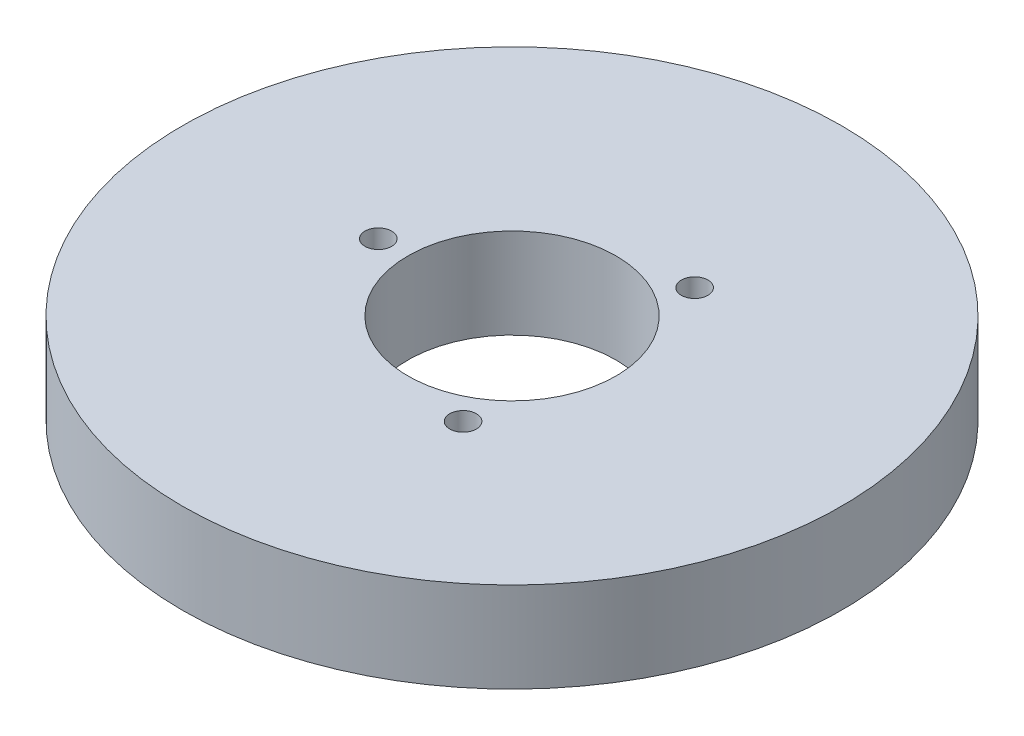
ISO-10303-21;
HEADER;
FILE_DESCRIPTION(('STEP AP214'),'2;1');
FILE_NAME('part.step','',(''),(''),'','','');
FILE_SCHEMA(('AUTOMOTIVE_DESIGN { 1 0 10303 214 1 1 1 1 }'));
ENDSEC;
DATA;
#1=APPLICATION_CONTEXT('core data for automotive mechanical design processes');
#2=APPLICATION_PROTOCOL_DEFINITION('international standard','automotive_design',2000,#1);
#3=PRODUCT_CONTEXT('',#1,'mechanical');
#4=PRODUCT('Part','Part','',(#3));
#5=PRODUCT_RELATED_PRODUCT_CATEGORY('part','',(#4));
#6=PRODUCT_DEFINITION_FORMATION('','',#4);
#7=PRODUCT_DEFINITION_CONTEXT('part definition',#1,'design');
#8=PRODUCT_DEFINITION('design','',#6,#7);
#9=PRODUCT_DEFINITION_SHAPE('','',#8);
#10=(LENGTH_UNIT() NAMED_UNIT(*) SI_UNIT(.MILLI.,.METRE.));
#11=(NAMED_UNIT(*) PLANE_ANGLE_UNIT() SI_UNIT($,.RADIAN.));
#12=(NAMED_UNIT(*) SI_UNIT($,.STERADIAN.) SOLID_ANGLE_UNIT());
#13=UNCERTAINTY_MEASURE_WITH_UNIT(LENGTH_MEASURE(1.E-05),#10,'distance_accuracy_value','');
#14=(GEOMETRIC_REPRESENTATION_CONTEXT(3) GLOBAL_UNCERTAINTY_ASSIGNED_CONTEXT((#13)) GLOBAL_UNIT_ASSIGNED_CONTEXT((#10,
#11,#12)) REPRESENTATION_CONTEXT('',''));
#15=CARTESIAN_POINT('',(0.,0.,0.));
#16=DIRECTION('',(0.,0.,1.));
#17=DIRECTION('',(1.,0.,0.));
#18=AXIS2_PLACEMENT_3D('',#15,#16,#17);
#19=CARTESIAN_POINT('',(0.,13.,0.));
#20=DIRECTION('',(0.,-1.,0.));
#21=DIRECTION('',(0.,0.,-1.));
#22=AXIS2_PLACEMENT_3D('',#19,#20,#21);
#23=CYLINDRICAL_SURFACE('',#22,47.5);
#24=CARTESIAN_POINT('',(0.,13.,0.));
#25=DIRECTION('',(0.,1.,0.));
#26=DIRECTION('',(0.,0.,1.));
#27=AXIS2_PLACEMENT_3D('',#24,#25,#26);
#28=CIRCLE('',#27,47.5);
#29=CARTESIAN_POINT('',(0.,13.,-47.5));
#30=VERTEX_POINT('',#29);
#31=EDGE_CURVE('E10',#30,#30,#28,.T.);
#32=CARTESIAN_POINT('',(0.,0.,0.));
#33=DIRECTION('',(0.,1.,0.));
#34=DIRECTION('',(0.,0.,1.));
#35=AXIS2_PLACEMENT_3D('',#32,#33,#34);
#36=CIRCLE('',#35,47.5);
#37=CARTESIAN_POINT('',(0.,0.,-47.5));
#38=VERTEX_POINT('',#37);
#39=EDGE_CURVE('E37',#38,#38,#36,.T.);
#40=CARTESIAN_POINT('',(0.,13.,-47.5));
#41=CARTESIAN_POINT('',(0.,12.8645833333333,-47.5));
#42=CARTESIAN_POINT('',(0.,12.7291666666667,-47.5));
#43=CARTESIAN_POINT('',(0.,12.4583333333333,-47.5));
#44=CARTESIAN_POINT('',(0.,12.3229166666667,-47.5));
#45=CARTESIAN_POINT('',(0.,12.0520833333333,-47.5));
#46=CARTESIAN_POINT('',(0.,11.9166666666667,-47.5));
#47=CARTESIAN_POINT('',(0.,11.6458333333333,-47.5));
#48=CARTESIAN_POINT('',(0.,11.5104166666667,-47.5));
#49=CARTESIAN_POINT('',(0.,11.2395833333333,-47.5));
#50=CARTESIAN_POINT('',(0.,11.1041666666667,-47.5));
#51=CARTESIAN_POINT('',(0.,10.8333333333333,-47.5));
#52=CARTESIAN_POINT('',(0.,10.6979166666667,-47.5));
#53=CARTESIAN_POINT('',(0.,10.4270833333333,-47.5));
#54=CARTESIAN_POINT('',(0.,10.2916666666667,-47.5));
#55=CARTESIAN_POINT('',(0.,10.0208333333333,-47.5));
#56=CARTESIAN_POINT('',(0.,9.88541666666667,-47.5));
#57=CARTESIAN_POINT('',(0.,9.61458333333333,-47.5));
#58=CARTESIAN_POINT('',(0.,9.47916666666667,-47.5));
#59=CARTESIAN_POINT('',(0.,9.20833333333333,-47.5));
#60=CARTESIAN_POINT('',(0.,9.07291666666666,-47.5));
#61=CARTESIAN_POINT('',(0.,8.80208333333333,-47.5));
#62=CARTESIAN_POINT('',(0.,8.66666666666667,-47.5));
#63=CARTESIAN_POINT('',(0.,8.39583333333333,-47.5));
#64=CARTESIAN_POINT('',(0.,8.26041666666667,-47.5));
#65=CARTESIAN_POINT('',(0.,7.98958333333333,-47.5));
#66=CARTESIAN_POINT('',(0.,7.85416666666667,-47.5));
#67=CARTESIAN_POINT('',(0.,7.58333333333333,-47.5));
#68=CARTESIAN_POINT('',(0.,7.44791666666667,-47.5));
#69=CARTESIAN_POINT('',(0.,7.17708333333333,-47.5));
#70=CARTESIAN_POINT('',(0.,7.04166666666667,-47.5));
#71=CARTESIAN_POINT('',(0.,6.77083333333333,-47.5));
#72=CARTESIAN_POINT('',(0.,6.63541666666667,-47.5));
#73=CARTESIAN_POINT('',(0.,6.36458333333333,-47.5));
#74=CARTESIAN_POINT('',(0.,6.22916666666667,-47.5));
#75=CARTESIAN_POINT('',(0.,5.95833333333333,-47.5));
#76=CARTESIAN_POINT('',(0.,5.82291666666667,-47.5));
#77=CARTESIAN_POINT('',(0.,5.55208333333333,-47.5));
#78=CARTESIAN_POINT('',(0.,5.41666666666667,-47.5));
#79=CARTESIAN_POINT('',(0.,5.14583333333333,-47.5));
#80=CARTESIAN_POINT('',(0.,5.01041666666667,-47.5));
#81=CARTESIAN_POINT('',(0.,4.73958333333333,-47.5));
#82=CARTESIAN_POINT('',(0.,4.60416666666667,-47.5));
#83=CARTESIAN_POINT('',(0.,4.33333333333333,-47.5));
#84=CARTESIAN_POINT('',(0.,4.19791666666667,-47.5));
#85=CARTESIAN_POINT('',(0.,3.92708333333333,-47.5));
#86=CARTESIAN_POINT('',(0.,3.79166666666667,-47.5));
#87=CARTESIAN_POINT('',(0.,3.52083333333333,-47.5));
#88=CARTESIAN_POINT('',(0.,3.38541666666667,-47.5));
#89=CARTESIAN_POINT('',(0.,3.11458333333333,-47.5));
#90=CARTESIAN_POINT('',(0.,2.97916666666667,-47.5));
#91=CARTESIAN_POINT('',(0.,2.70833333333333,-47.5));
#92=CARTESIAN_POINT('',(0.,2.57291666666667,-47.5));
#93=CARTESIAN_POINT('',(0.,2.30208333333333,-47.5));
#94=CARTESIAN_POINT('',(0.,2.16666666666667,-47.5));
#95=CARTESIAN_POINT('',(0.,1.89583333333333,-47.5));
#96=CARTESIAN_POINT('',(0.,1.76041666666667,-47.5));
#97=CARTESIAN_POINT('',(0.,1.48958333333333,-47.5));
#98=CARTESIAN_POINT('',(0.,1.35416666666667,-47.5));
#99=CARTESIAN_POINT('',(0.,1.08333333333333,-47.5));
#100=CARTESIAN_POINT('',(0.,0.947916666666667,-47.5));
#101=CARTESIAN_POINT('',(0.,0.677083333333334,-47.5));
#102=CARTESIAN_POINT('',(0.,0.541666666666667,-47.5));
#103=CARTESIAN_POINT('',(0.,0.270833333333334,-47.5));
#104=CARTESIAN_POINT('',(0.,0.135416666666667,-47.5));
#105=CARTESIAN_POINT('',(0.,0.,-47.5));
#106=B_SPLINE_CURVE_WITH_KNOTS('',3,(#40,#41,#42,#43,#44,#45,#46,#47,#48,#49,#50,#51,#52,#53,
#54,#55,#56,#57,#58,#59,#60,#61,#62,#63,#64,#65,#66,#67,#68,#69,#70,#71,#72,#73,#74,#75,#76,#77,
#78,#79,#80,#81,#82,#83,#84,#85,#86,#87,#88,#89,#90,#91,#92,#93,#94,#95,#96,#97,#98,#99,#100,
#101,#102,#103,#104,#105),.UNSPECIFIED.,.F.,.F.,(4,2,2,2,2,2,2,2,2,2,2,2,2,2,2,2,2,2,2,2,2,2,2,
2,2,2,2,2,2,2,2,2,4),(0.,0.40625,0.812500000000001,1.21875,1.625,2.03125,2.4375,2.84375,3.25,
3.65625,4.0625,4.46875,4.875,5.28125,5.6875,6.09375,6.5,6.90625,7.3125,7.71875,8.125,8.53125,
8.9375,9.34375,9.75,10.15625,10.5625,10.96875,11.375,11.78125,12.1875,12.59375,13.),.UNSPECIFIED.);
#107=EDGE_CURVE('BSEAM40',#30,#38,#106,.T.);
#108=ORIENTED_EDGE('',*,*,#31,.F.);
#109=ORIENTED_EDGE('',*,*,#39,.T.);
#110=ORIENTED_EDGE('',*,*,#107,.T.);
#111=ORIENTED_EDGE('',*,*,#107,.F.);
#112=EDGE_LOOP('',(#108,#110,#109,#111));
#113=FACE_BOUND('',#112,.T.);
#114=ADVANCED_FACE('F40',(#113),#23,.T.);
#115=CARTESIAN_POINT('',(0.,13.,0.));
#116=DIRECTION('',(0.,1.,0.));
#117=DIRECTION('',(0.,0.,1.));
#118=AXIS2_PLACEMENT_3D('',#115,#116,#117);
#119=PLANE('',#118);
#120=CARTESIAN_POINT('',(9.63567687789296,13.,16.6894819178271));
#121=DIRECTION('',(0.,1.,0.));
#122=DIRECTION('',(0.866025403784436,0.,-0.500000000000004));
#123=AXIS2_PLACEMENT_3D('',#120,#121,#122);
#124=CIRCLE('',#123,1.91689370131754);
#125=CARTESIAN_POINT('',(11.2957555195883,13.,15.7310350671683));
#126=VERTEX_POINT('',#125);
#127=EDGE_CURVE('E70',#126,#126,#124,.T.);
#128=ORIENTED_EDGE('',*,*,#127,.F.);
#129=EDGE_LOOP('',(#128));
#130=FACE_BOUND('',#129,.T.);
#131=CARTESIAN_POINT('',(9.63567687789273,13.,-16.6894819178272));
#132=DIRECTION('',(0.,1.,0.));
#133=DIRECTION('',(-0.866025403784443,0.,-0.499999999999992));
#134=AXIS2_PLACEMENT_3D('',#131,#132,#133);
#135=CIRCLE('',#134,1.91689370131754);
#136=CARTESIAN_POINT('',(7.97559823619735,13.,-17.647928768486));
#137=VERTEX_POINT('',#136);
#138=EDGE_CURVE('E61',#137,#137,#135,.T.);
#139=ORIENTED_EDGE('',*,*,#138,.F.);
#140=EDGE_LOOP('',(#139));
#141=FACE_BOUND('',#140,.T.);
#142=CARTESIAN_POINT('',(-19.2713537557858,13.,0.));
#143=DIRECTION('',(0.,1.,0.));
#144=DIRECTION('',(0.,0.,1.));
#145=AXIS2_PLACEMENT_3D('',#142,#143,#144);
#146=CIRCLE('',#145,1.91689370131754);
#147=CARTESIAN_POINT('',(-19.2713537557858,13.,1.91689370131754));
#148=VERTEX_POINT('',#147);
#149=EDGE_CURVE('E54',#148,#148,#146,.T.);
#150=ORIENTED_EDGE('',*,*,#149,.F.);
#151=EDGE_LOOP('',(#150));
#152=FACE_BOUND('',#151,.T.);
#153=CARTESIAN_POINT('',(0.,13.,0.));
#154=DIRECTION('',(0.,1.,0.));
#155=DIRECTION('',(0.,0.,1.));
#156=AXIS2_PLACEMENT_3D('',#153,#154,#155);
#157=CIRCLE('',#156,15.);
#158=CARTESIAN_POINT('',(0.,13.,-15.));
#159=VERTEX_POINT('',#158);
#160=EDGE_CURVE('E50',#159,#159,#157,.T.);
#161=ORIENTED_EDGE('',*,*,#160,.F.);
#162=EDGE_LOOP('',(#161));
#163=FACE_BOUND('',#162,.T.);
#164=ORIENTED_EDGE('',*,*,#31,.T.);
#165=EDGE_LOOP('',(#164));
#166=FACE_BOUND('',#165,.T.);
#167=ADVANCED_FACE('F85',(#130,#141,#152,#163,#166),#119,.T.);
#168=CARTESIAN_POINT('',(0.,0.,0.));
#169=DIRECTION('',(0.,1.,0.));
#170=DIRECTION('',(0.,0.,1.));
#171=AXIS2_PLACEMENT_3D('',#168,#169,#170);
#172=PLANE('',#171);
#173=CARTESIAN_POINT('',(0.,0.,0.));
#174=DIRECTION('',(0.,1.,0.));
#175=DIRECTION('',(0.,0.,1.));
#176=AXIS2_PLACEMENT_3D('',#173,#174,#175);
#177=CIRCLE('',#176,15.);
#178=CARTESIAN_POINT('',(0.,0.,-15.));
#179=VERTEX_POINT('',#178);
#180=EDGE_CURVE('E47',#179,#179,#177,.T.);
#181=ORIENTED_EDGE('',*,*,#180,.T.);
#182=EDGE_LOOP('',(#181));
#183=FACE_BOUND('',#182,.T.);
#184=ORIENTED_EDGE('',*,*,#39,.F.);
#185=EDGE_LOOP('',(#184));
#186=FACE_BOUND('',#185,.T.);
#187=ADVANCED_FACE('F84',(#183,#186),#172,.F.);
#188=CARTESIAN_POINT('',(0.,13.,0.));
#189=DIRECTION('',(0.,-1.,0.));
#190=DIRECTION('',(0.,0.,-1.));
#191=AXIS2_PLACEMENT_3D('',#188,#189,#190);
#192=CYLINDRICAL_SURFACE('',#191,15.);
#193=CARTESIAN_POINT('',(0.,13.,-15.));
#194=CARTESIAN_POINT('',(0.,12.8645833333333,-15.));
#195=CARTESIAN_POINT('',(0.,12.7291666666667,-15.));
#196=CARTESIAN_POINT('',(0.,12.4583333333333,-15.));
#197=CARTESIAN_POINT('',(0.,12.3229166666667,-15.));
#198=CARTESIAN_POINT('',(0.,12.0520833333333,-15.));
#199=CARTESIAN_POINT('',(0.,11.9166666666667,-15.));
#200=CARTESIAN_POINT('',(0.,11.6458333333333,-15.));
#201=CARTESIAN_POINT('',(0.,11.5104166666667,-15.));
#202=CARTESIAN_POINT('',(0.,11.2395833333333,-15.));
#203=CARTESIAN_POINT('',(0.,11.1041666666667,-15.));
#204=CARTESIAN_POINT('',(0.,10.8333333333333,-15.));
#205=CARTESIAN_POINT('',(0.,10.6979166666667,-15.));
#206=CARTESIAN_POINT('',(0.,10.4270833333333,-15.));
#207=CARTESIAN_POINT('',(0.,10.2916666666667,-15.));
#208=CARTESIAN_POINT('',(0.,10.0208333333333,-15.));
#209=CARTESIAN_POINT('',(0.,9.88541666666667,-15.));
#210=CARTESIAN_POINT('',(0.,9.61458333333333,-15.));
#211=CARTESIAN_POINT('',(0.,9.47916666666667,-15.));
#212=CARTESIAN_POINT('',(0.,9.20833333333333,-15.));
#213=CARTESIAN_POINT('',(0.,9.07291666666666,-15.));
#214=CARTESIAN_POINT('',(0.,8.80208333333333,-15.));
#215=CARTESIAN_POINT('',(0.,8.66666666666667,-15.));
#216=CARTESIAN_POINT('',(0.,8.39583333333333,-15.));
#217=CARTESIAN_POINT('',(0.,8.26041666666667,-15.));
#218=CARTESIAN_POINT('',(0.,7.98958333333333,-15.));
#219=CARTESIAN_POINT('',(0.,7.85416666666667,-15.));
#220=CARTESIAN_POINT('',(0.,7.58333333333333,-15.));
#221=CARTESIAN_POINT('',(0.,7.44791666666667,-15.));
#222=CARTESIAN_POINT('',(0.,7.17708333333333,-15.));
#223=CARTESIAN_POINT('',(0.,7.04166666666667,-15.));
#224=CARTESIAN_POINT('',(0.,6.77083333333333,-15.));
#225=CARTESIAN_POINT('',(0.,6.63541666666667,-15.));
#226=CARTESIAN_POINT('',(0.,6.36458333333333,-15.));
#227=CARTESIAN_POINT('',(0.,6.22916666666667,-15.));
#228=CARTESIAN_POINT('',(0.,5.95833333333333,-15.));
#229=CARTESIAN_POINT('',(0.,5.82291666666667,-15.));
#230=CARTESIAN_POINT('',(0.,5.55208333333333,-15.));
#231=CARTESIAN_POINT('',(0.,5.41666666666667,-15.));
#232=CARTESIAN_POINT('',(0.,5.14583333333333,-15.));
#233=CARTESIAN_POINT('',(0.,5.01041666666667,-15.));
#234=CARTESIAN_POINT('',(0.,4.73958333333333,-15.));
#235=CARTESIAN_POINT('',(0.,4.60416666666667,-15.));
#236=CARTESIAN_POINT('',(0.,4.33333333333333,-15.));
#237=CARTESIAN_POINT('',(0.,4.19791666666667,-15.));
#238=CARTESIAN_POINT('',(0.,3.92708333333333,-15.));
#239=CARTESIAN_POINT('',(0.,3.79166666666667,-15.));
#240=CARTESIAN_POINT('',(0.,3.52083333333333,-15.));
#241=CARTESIAN_POINT('',(0.,3.38541666666667,-15.));
#242=CARTESIAN_POINT('',(0.,3.11458333333333,-15.));
#243=CARTESIAN_POINT('',(0.,2.97916666666667,-15.));
#244=CARTESIAN_POINT('',(0.,2.70833333333333,-15.));
#245=CARTESIAN_POINT('',(0.,2.57291666666667,-15.));
#246=CARTESIAN_POINT('',(0.,2.30208333333333,-15.));
#247=CARTESIAN_POINT('',(0.,2.16666666666667,-15.));
#248=CARTESIAN_POINT('',(0.,1.89583333333333,-15.));
#249=CARTESIAN_POINT('',(0.,1.76041666666667,-15.));
#250=CARTESIAN_POINT('',(0.,1.48958333333333,-15.));
#251=CARTESIAN_POINT('',(0.,1.35416666666667,-15.));
#252=CARTESIAN_POINT('',(0.,1.08333333333333,-15.));
#253=CARTESIAN_POINT('',(0.,0.947916666666667,-15.));
#254=CARTESIAN_POINT('',(0.,0.677083333333334,-15.));
#255=CARTESIAN_POINT('',(0.,0.541666666666667,-15.));
#256=CARTESIAN_POINT('',(0.,0.270833333333334,-15.));
#257=CARTESIAN_POINT('',(0.,0.135416666666667,-15.));
#258=CARTESIAN_POINT('',(0.,0.,-15.));
#259=B_SPLINE_CURVE_WITH_KNOTS('',3,(#193,#194,#195,#196,#197,#198,#199,#200,#201,#202,#203,
#204,#205,#206,#207,#208,#209,#210,#211,#212,#213,#214,#215,#216,#217,#218,#219,#220,#221,#222,
#223,#224,#225,#226,#227,#228,#229,#230,#231,#232,#233,#234,#235,#236,#237,#238,#239,#240,#241,
#242,#243,#244,#245,#246,#247,#248,#249,#250,#251,#252,#253,#254,#255,#256,#257,#258),
.UNSPECIFIED.,.F.,.F.,(4,2,2,2,2,2,2,2,2,2,2,2,2,2,2,2,2,2,2,2,2,2,2,2,2,2,2,2,2,2,2,2,4),(0.,
0.40625,0.812500000000001,1.21875,1.625,2.03125,2.4375,2.84375,3.25,3.65625,4.0625,4.46875,
4.875,5.28125,5.6875,6.09375,6.5,6.90625,7.3125,7.71875,8.125,8.53125,8.9375,9.34375,9.75,
10.15625,10.5625,10.96875,11.375,11.78125,12.1875,12.59375,13.),.UNSPECIFIED.);
#260=EDGE_CURVE('BSEAM91',#159,#179,#259,.T.);
#261=ORIENTED_EDGE('',*,*,#160,.T.);
#262=ORIENTED_EDGE('',*,*,#180,.F.);
#263=ORIENTED_EDGE('',*,*,#260,.T.);
#264=ORIENTED_EDGE('',*,*,#260,.F.);
#265=EDGE_LOOP('',(#261,#263,#262,#264));
#266=FACE_BOUND('',#265,.T.);
#267=ADVANCED_FACE('F91',(#266),#192,.F.);
#268=CARTESIAN_POINT('',(-19.2713537557858,5.05799581632523,0.));
#269=DIRECTION('',(0.,1.,0.));
#270=DIRECTION('',(0.,0.,1.));
#271=AXIS2_PLACEMENT_3D('',#268,#269,#270);
#272=CYLINDRICAL_SURFACE('',#271,1.91689370131754);
#273=CARTESIAN_POINT('',(-19.2713537557858,5.05799581632523,0.));
#274=DIRECTION('',(0.,1.,0.));
#275=DIRECTION('',(0.,0.,1.));
#276=AXIS2_PLACEMENT_3D('',#273,#274,#275);
#277=CIRCLE('',#276,1.91689370131754);
#278=CARTESIAN_POINT('',(-19.2713537557858,5.05799581632523,1.91689370131754));
#279=VERTEX_POINT('',#278);
#280=EDGE_CURVE('E55',#279,#279,#277,.T.);
#281=ORIENTED_EDGE('',*,*,#280,.F.);
#282=EDGE_LOOP('',(#281));
#283=FACE_BOUND('',#282,.T.);
#284=ORIENTED_EDGE('',*,*,#149,.T.);
#285=EDGE_LOOP('',(#284));
#286=FACE_BOUND('',#285,.T.);
#287=ADVANCED_FACE('F96',(#283,#286),#272,.F.);
#288=CARTESIAN_POINT('',(-19.2713537557858,5.05799581632523,0.));
#289=DIRECTION('',(0.,1.,0.));
#290=DIRECTION('',(0.,0.,1.));
#291=AXIS2_PLACEMENT_3D('',#288,#289,#290);
#292=PLANE('',#291);
#293=ORIENTED_EDGE('',*,*,#280,.T.);
#294=EDGE_LOOP('',(#293));
#295=FACE_BOUND('',#294,.T.);
#296=ADVANCED_FACE('F127',(#295),#292,.T.);
#297=CARTESIAN_POINT('',(9.63567687789273,5.05799581632523,-16.6894819178272));
#298=DIRECTION('',(0.,1.,0.));
#299=DIRECTION('',(0.,0.,1.));
#300=AXIS2_PLACEMENT_3D('',#297,#298,#299);
#301=CYLINDRICAL_SURFACE('',#300,1.91689370131754);
#302=CARTESIAN_POINT('',(9.63567687789273,5.05799581632523,-16.6894819178272));
#303=DIRECTION('',(0.,1.,0.));
#304=DIRECTION('',(-0.866025403784443,0.,-0.499999999999992));
#305=AXIS2_PLACEMENT_3D('',#302,#303,#304);
#306=CIRCLE('',#305,1.91689370131754);
#307=CARTESIAN_POINT('',(7.97559823619735,5.05799581632523,-17.647928768486));
#308=VERTEX_POINT('',#307);
#309=EDGE_CURVE('E63',#308,#308,#306,.T.);
#310=ORIENTED_EDGE('',*,*,#309,.F.);
#311=EDGE_LOOP('',(#310));
#312=FACE_BOUND('',#311,.T.);
#313=ORIENTED_EDGE('',*,*,#138,.T.);
#314=EDGE_LOOP('',(#313));
#315=FACE_BOUND('',#314,.T.);
#316=ADVANCED_FACE('F133',(#312,#315),#301,.F.);
#317=CARTESIAN_POINT('',(9.63567687789273,5.05799581632523,-16.6894819178272));
#318=DIRECTION('',(0.,1.,0.));
#319=DIRECTION('',(-0.866025403784443,0.,-0.499999999999992));
#320=AXIS2_PLACEMENT_3D('',#317,#318,#319);
#321=PLANE('',#320);
#322=ORIENTED_EDGE('',*,*,#309,.T.);
#323=EDGE_LOOP('',(#322));
#324=FACE_BOUND('',#323,.T.);
#325=ADVANCED_FACE('F77',(#324),#321,.T.);
#326=CARTESIAN_POINT('',(9.63567687789296,5.05799581632523,16.6894819178271));
#327=DIRECTION('',(0.,1.,0.));
#328=DIRECTION('',(0.,0.,1.));
#329=AXIS2_PLACEMENT_3D('',#326,#327,#328);
#330=CYLINDRICAL_SURFACE('',#329,1.91689370131754);
#331=CARTESIAN_POINT('',(9.63567687789296,5.05799581632523,16.6894819178271));
#332=DIRECTION('',(0.,1.,0.));
#333=DIRECTION('',(0.866025403784436,0.,-0.500000000000004));
#334=AXIS2_PLACEMENT_3D('',#331,#332,#333);
#335=CIRCLE('',#334,1.91689370131754);
#336=CARTESIAN_POINT('',(11.2957555195883,5.05799581632523,15.7310350671683));
#337=VERTEX_POINT('',#336);
#338=EDGE_CURVE('E59',#337,#337,#335,.T.);
#339=ORIENTED_EDGE('',*,*,#338,.F.);
#340=EDGE_LOOP('',(#339));
#341=FACE_BOUND('',#340,.T.);
#342=ORIENTED_EDGE('',*,*,#127,.T.);
#343=EDGE_LOOP('',(#342));
#344=FACE_BOUND('',#343,.T.);
#345=ADVANCED_FACE('F73',(#341,#344),#330,.F.);
#346=CARTESIAN_POINT('',(9.63567687789296,5.05799581632523,16.6894819178271));
#347=DIRECTION('',(0.,1.,0.));
#348=DIRECTION('',(0.866025403784436,0.,-0.500000000000004));
#349=AXIS2_PLACEMENT_3D('',#346,#347,#348);
#350=PLANE('',#349);
#351=ORIENTED_EDGE('',*,*,#338,.T.);
#352=EDGE_LOOP('',(#351));
#353=FACE_BOUND('',#352,.T.);
#354=ADVANCED_FACE('F71',(#353),#350,.T.);
#355=CLOSED_SHELL('',(#114,#167,#187,#267,#287,#296,#316,#325,#345,#354));
#356=MANIFOLD_SOLID_BREP('B2',#355);
#357=ADVANCED_BREP_SHAPE_REPRESENTATION('',(#18,#356),#14);
#358=SHAPE_DEFINITION_REPRESENTATION(#9,#357);
ENDSEC;
END-ISO-10303-21;
